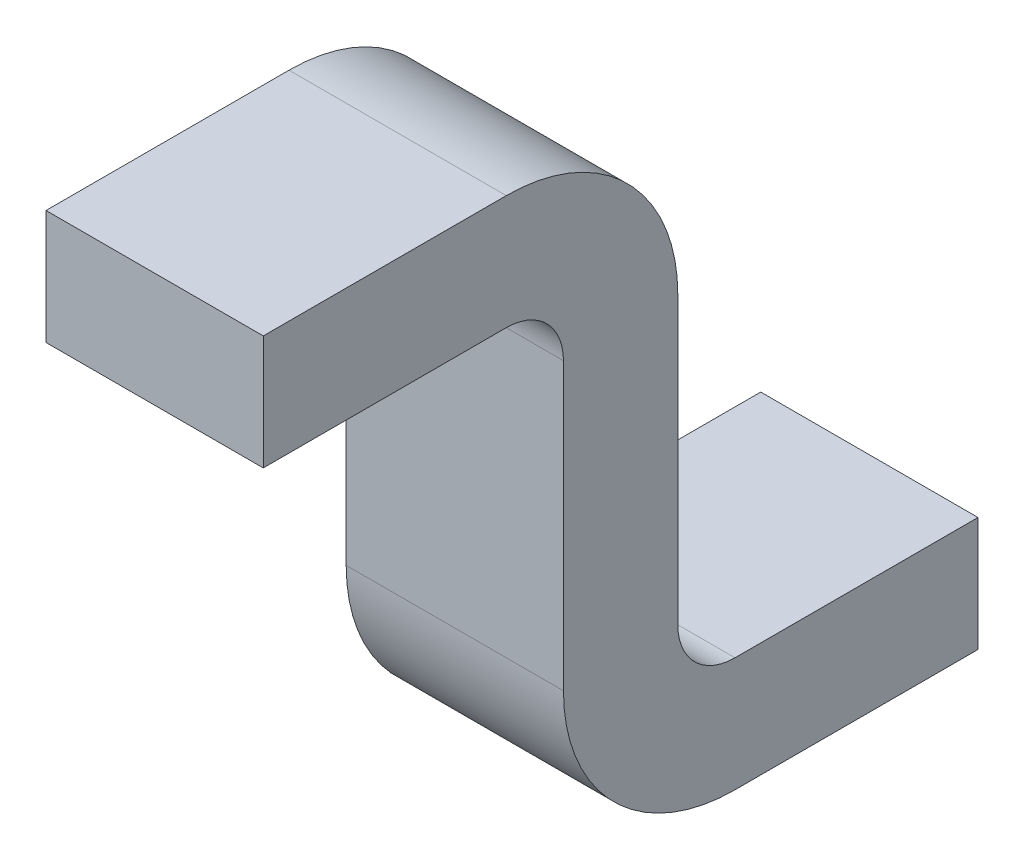
ISO-10303-21;
HEADER;
FILE_DESCRIPTION(('STEP AP214'),'2;1');
FILE_NAME('part.step','',(''),(''),'','','');
FILE_SCHEMA(('AUTOMOTIVE_DESIGN { 1 0 10303 214 1 1 1 1 }'));
ENDSEC;
DATA;
#1=APPLICATION_CONTEXT('core data for automotive mechanical design processes');
#2=APPLICATION_PROTOCOL_DEFINITION('international standard','automotive_design',2000,#1);
#3=PRODUCT_CONTEXT('',#1,'mechanical');
#4=PRODUCT('Part','Part','',(#3));
#5=PRODUCT_RELATED_PRODUCT_CATEGORY('part','',(#4));
#6=PRODUCT_DEFINITION_FORMATION('','',#4);
#7=PRODUCT_DEFINITION_CONTEXT('part definition',#1,'design');
#8=PRODUCT_DEFINITION('design','',#6,#7);
#9=PRODUCT_DEFINITION_SHAPE('','',#8);
#10=(LENGTH_UNIT() NAMED_UNIT(*) SI_UNIT(.MILLI.,.METRE.));
#11=(NAMED_UNIT(*) PLANE_ANGLE_UNIT() SI_UNIT($,.RADIAN.));
#12=(NAMED_UNIT(*) SI_UNIT($,.STERADIAN.) SOLID_ANGLE_UNIT());
#13=UNCERTAINTY_MEASURE_WITH_UNIT(LENGTH_MEASURE(1.E-05),#10,'distance_accuracy_value','');
#14=(GEOMETRIC_REPRESENTATION_CONTEXT(3) GLOBAL_UNCERTAINTY_ASSIGNED_CONTEXT((#13)) GLOBAL_UNIT_ASSIGNED_CONTEXT((#10,
#11,#12)) REPRESENTATION_CONTEXT('',''));
#15=CARTESIAN_POINT('',(0.,0.,0.));
#16=DIRECTION('',(0.,0.,1.));
#17=DIRECTION('',(1.,0.,0.));
#18=AXIS2_PLACEMENT_3D('',#15,#16,#17);
#19=CARTESIAN_POINT('',(0.38,0.8,-0.425));
#20=DIRECTION('',(-1.,0.,0.));
#21=DIRECTION('',(0.,0.,1.));
#22=AXIS2_PLACEMENT_3D('',#19,#20,#21);
#23=CYLINDRICAL_SURFACE('',#22,0.1);
#24=CARTESIAN_POINT('',(0.,0.8,-0.425));
#25=DIRECTION('',(-1.,0.,0.));
#26=DIRECTION('',(0.,0.,-1.));
#27=AXIS2_PLACEMENT_3D('',#24,#25,#26);
#28=CIRCLE('',#27,0.1);
#29=CARTESIAN_POINT('',(0.,0.9,-0.424999999999999));
#30=VERTEX_POINT('',#29);
#31=CARTESIAN_POINT('',(0.,0.799999999999999,-0.525));
#32=VERTEX_POINT('',#31);
#33=EDGE_CURVE('E151',#30,#32,#28,.T.);
#34=ORIENTED_EDGE('',*,*,#33,.T.);
#35=DIRECTION('',(-1.,0.,0.));
#36=VECTOR('',#35,1.);
#37=CARTESIAN_POINT('',(0.38,0.799999999999999,-0.525));
#38=LINE('',#37,#36);
#39=CARTESIAN_POINT('',(0.38,0.799999999999999,-0.525));
#40=VERTEX_POINT('',#39);
#41=EDGE_CURVE('E11',#40,#32,#38,.T.);
#42=ORIENTED_EDGE('',*,*,#41,.F.);
#43=CARTESIAN_POINT('',(0.38,0.8,-0.425));
#44=DIRECTION('',(-1.,0.,0.));
#45=DIRECTION('',(0.,0.,-1.));
#46=AXIS2_PLACEMENT_3D('',#43,#44,#45);
#47=CIRCLE('',#46,0.1);
#48=CARTESIAN_POINT('',(0.38,0.9,-0.424999999999999));
#49=VERTEX_POINT('',#48);
#50=EDGE_CURVE('E173',#49,#40,#47,.T.);
#51=ORIENTED_EDGE('',*,*,#50,.F.);
#52=DIRECTION('',(-1.,0.,0.));
#53=VECTOR('',#52,1.);
#54=CARTESIAN_POINT('',(0.38,0.9,-0.424999999999999));
#55=LINE('',#54,#53);
#56=EDGE_CURVE('E147',#49,#30,#55,.T.);
#57=ORIENTED_EDGE('',*,*,#56,.T.);
#58=EDGE_LOOP('',(#34,#42,#51,#57));
#59=FACE_BOUND('',#58,.T.);
#60=ADVANCED_FACE('F31',(#59),#23,.F.);
#61=CARTESIAN_POINT('',(0.38,0.799999999999999,-0.525));
#62=DIRECTION('',(0.,0.,-1.));
#63=DIRECTION('',(0.,1.,0.));
#64=AXIS2_PLACEMENT_3D('',#61,#62,#63);
#65=PLANE('',#64);
#66=DIRECTION('',(0.,-1.,0.));
#67=VECTOR('',#66,1.);
#68=CARTESIAN_POINT('',(0.,0.799999999999999,-0.525));
#69=LINE('',#68,#67);
#70=CARTESIAN_POINT('',(0.,0.300000000000002,-0.525));
#71=VERTEX_POINT('',#70);
#72=EDGE_CURVE('E154',#32,#71,#69,.T.);
#73=ORIENTED_EDGE('',*,*,#72,.T.);
#74=DIRECTION('',(-1.,0.,0.));
#75=VECTOR('',#74,1.);
#76=CARTESIAN_POINT('',(0.38,0.300000000000002,-0.525));
#77=LINE('',#76,#75);
#78=CARTESIAN_POINT('',(0.38,0.300000000000002,-0.525));
#79=VERTEX_POINT('',#78);
#80=EDGE_CURVE('E39',#79,#71,#77,.T.);
#81=ORIENTED_EDGE('',*,*,#80,.F.);
#82=DIRECTION('',(0.,-1.,0.));
#83=VECTOR('',#82,1.);
#84=CARTESIAN_POINT('',(0.38,0.799999999999999,-0.525));
#85=LINE('',#84,#83);
#86=EDGE_CURVE('E102',#40,#79,#85,.T.);
#87=ORIENTED_EDGE('',*,*,#86,.F.);
#88=ORIENTED_EDGE('',*,*,#41,.T.);
#89=EDGE_LOOP('',(#73,#81,#87,#88));
#90=FACE_BOUND('',#89,.T.);
#91=ADVANCED_FACE('F251',(#90),#65,.F.);
#92=CARTESIAN_POINT('',(0.38,0.3,-0.825));
#93=DIRECTION('',(-1.,0.,0.));
#94=DIRECTION('',(0.,0.,1.));
#95=AXIS2_PLACEMENT_3D('',#92,#93,#94);
#96=CYLINDRICAL_SURFACE('',#95,0.3);
#97=CARTESIAN_POINT('',(0.,0.3,-0.825));
#98=DIRECTION('',(1.,0.,0.));
#99=DIRECTION('',(0.,0.,1.));
#100=AXIS2_PLACEMENT_3D('',#97,#98,#99);
#101=CIRCLE('',#100,0.3);
#102=CARTESIAN_POINT('',(0.,0.,-0.825000000000003));
#103=VERTEX_POINT('',#102);
#104=EDGE_CURVE('E156',#71,#103,#101,.T.);
#105=ORIENTED_EDGE('',*,*,#104,.T.);
#106=DIRECTION('',(-1.,0.,0.));
#107=VECTOR('',#106,1.);
#108=CARTESIAN_POINT('',(0.38,0.,-0.825000000000003));
#109=LINE('',#108,#107);
#110=CARTESIAN_POINT('',(0.38,0.,-0.825000000000003));
#111=VERTEX_POINT('',#110);
#112=EDGE_CURVE('E192',#111,#103,#109,.T.);
#113=ORIENTED_EDGE('',*,*,#112,.F.);
#114=CARTESIAN_POINT('',(0.38,0.3,-0.825));
#115=DIRECTION('',(1.,0.,0.));
#116=DIRECTION('',(0.,0.,1.));
#117=AXIS2_PLACEMENT_3D('',#114,#115,#116);
#118=CIRCLE('',#117,0.3);
#119=EDGE_CURVE('E200',#79,#111,#118,.T.);
#120=ORIENTED_EDGE('',*,*,#119,.F.);
#121=ORIENTED_EDGE('',*,*,#80,.T.);
#122=EDGE_LOOP('',(#105,#113,#120,#121));
#123=FACE_BOUND('',#122,.T.);
#124=ADVANCED_FACE('F198',(#123),#96,.T.);
#125=CARTESIAN_POINT('',(0.38,0.,-0.825000000000003));
#126=DIRECTION('',(0.,1.,0.));
#127=DIRECTION('',(0.,0.,1.));
#128=AXIS2_PLACEMENT_3D('',#125,#126,#127);
#129=PLANE('',#128);
#130=DIRECTION('',(0.,0.,-1.));
#131=VECTOR('',#130,1.);
#132=CARTESIAN_POINT('',(0.,0.,-0.825000000000003));
#133=LINE('',#132,#131);
#134=CARTESIAN_POINT('',(0.,0.,-1.25));
#135=VERTEX_POINT('',#134);
#136=EDGE_CURVE('E158',#103,#135,#133,.T.);
#137=ORIENTED_EDGE('',*,*,#136,.T.);
#138=DIRECTION('',(-1.,0.,0.));
#139=VECTOR('',#138,1.);
#140=CARTESIAN_POINT('',(0.38,0.,-1.25));
#141=LINE('',#140,#139);
#142=CARTESIAN_POINT('',(0.38,0.,-1.25));
#143=VERTEX_POINT('',#142);
#144=EDGE_CURVE('E189',#143,#135,#141,.T.);
#145=ORIENTED_EDGE('',*,*,#144,.F.);
#146=DIRECTION('',(0.,0.,-1.));
#147=VECTOR('',#146,1.);
#148=CARTESIAN_POINT('',(0.38,0.,-0.825000000000003));
#149=LINE('',#148,#147);
#150=EDGE_CURVE('E218',#111,#143,#149,.T.);
#151=ORIENTED_EDGE('',*,*,#150,.F.);
#152=ORIENTED_EDGE('',*,*,#112,.T.);
#153=EDGE_LOOP('',(#137,#145,#151,#152));
#154=FACE_BOUND('',#153,.T.);
#155=ADVANCED_FACE('F209',(#154),#129,.F.);
#156=CARTESIAN_POINT('',(0.38,0.,-1.25));
#157=DIRECTION('',(0.,0.,1.));
#158=DIRECTION('',(1.,0.,0.));
#159=AXIS2_PLACEMENT_3D('',#156,#157,#158);
#160=PLANE('',#159);
#161=DIRECTION('',(0.,1.,0.));
#162=VECTOR('',#161,1.);
#163=CARTESIAN_POINT('',(0.,0.,-1.25));
#164=LINE('',#163,#162);
#165=CARTESIAN_POINT('',(0.,0.2,-1.25));
#166=VERTEX_POINT('',#165);
#167=EDGE_CURVE('E160',#135,#166,#164,.T.);
#168=ORIENTED_EDGE('',*,*,#167,.T.);
#169=DIRECTION('',(-1.,0.,0.));
#170=VECTOR('',#169,1.);
#171=CARTESIAN_POINT('',(0.38,0.2,-1.25));
#172=LINE('',#171,#170);
#173=CARTESIAN_POINT('',(0.38,0.2,-1.25));
#174=VERTEX_POINT('',#173);
#175=EDGE_CURVE('E186',#174,#166,#172,.T.);
#176=ORIENTED_EDGE('',*,*,#175,.F.);
#177=DIRECTION('',(0.,1.,0.));
#178=VECTOR('',#177,1.);
#179=CARTESIAN_POINT('',(0.38,0.,-1.25));
#180=LINE('',#179,#178);
#181=EDGE_CURVE('E215',#143,#174,#180,.T.);
#182=ORIENTED_EDGE('',*,*,#181,.F.);
#183=ORIENTED_EDGE('',*,*,#144,.T.);
#184=EDGE_LOOP('',(#168,#176,#182,#183));
#185=FACE_BOUND('',#184,.T.);
#186=ADVANCED_FACE('F213',(#185),#160,.F.);
#187=CARTESIAN_POINT('',(0.38,0.2,-0.825000000000001));
#188=DIRECTION('',(0.,-1.,0.));
#189=DIRECTION('',(0.,0.,-1.));
#190=AXIS2_PLACEMENT_3D('',#187,#188,#189);
#191=PLANE('',#190);
#192=DIRECTION('',(0.,0.,1.));
#193=VECTOR('',#192,1.);
#194=CARTESIAN_POINT('',(0.,0.2,-0.825000000000001));
#195=LINE('',#194,#193);
#196=CARTESIAN_POINT('',(0.,0.2,-0.825000000000001));
#197=VERTEX_POINT('',#196);
#198=EDGE_CURVE('E162',#166,#197,#195,.T.);
#199=ORIENTED_EDGE('',*,*,#198,.T.);
#200=DIRECTION('',(-1.,0.,0.));
#201=VECTOR('',#200,1.);
#202=CARTESIAN_POINT('',(0.38,0.2,-0.825000000000001));
#203=LINE('',#202,#201);
#204=CARTESIAN_POINT('',(0.38,0.2,-0.825000000000001));
#205=VERTEX_POINT('',#204);
#206=EDGE_CURVE('E183',#205,#197,#203,.T.);
#207=ORIENTED_EDGE('',*,*,#206,.F.);
#208=DIRECTION('',(0.,0.,1.));
#209=VECTOR('',#208,1.);
#210=CARTESIAN_POINT('',(0.38,0.2,-0.825000000000001));
#211=LINE('',#210,#209);
#212=EDGE_CURVE('E217',#174,#205,#211,.T.);
#213=ORIENTED_EDGE('',*,*,#212,.F.);
#214=ORIENTED_EDGE('',*,*,#175,.T.);
#215=EDGE_LOOP('',(#199,#207,#213,#214));
#216=FACE_BOUND('',#215,.T.);
#217=ADVANCED_FACE('F264',(#216),#191,.F.);
#218=CARTESIAN_POINT('',(0.38,0.3,-0.825));
#219=DIRECTION('',(-1.,0.,0.));
#220=DIRECTION('',(0.,0.,1.));
#221=AXIS2_PLACEMENT_3D('',#218,#219,#220);
#222=CYLINDRICAL_SURFACE('',#221,0.1);
#223=CARTESIAN_POINT('',(0.,0.3,-0.825));
#224=DIRECTION('',(-1.,0.,0.));
#225=DIRECTION('',(0.,0.,1.));
#226=AXIS2_PLACEMENT_3D('',#223,#224,#225);
#227=CIRCLE('',#226,0.1);
#228=CARTESIAN_POINT('',(0.,0.300000000000001,-0.725));
#229=VERTEX_POINT('',#228);
#230=EDGE_CURVE('E164',#197,#229,#227,.T.);
#231=ORIENTED_EDGE('',*,*,#230,.T.);
#232=DIRECTION('',(-1.,0.,0.));
#233=VECTOR('',#232,1.);
#234=CARTESIAN_POINT('',(0.38,0.300000000000001,-0.725));
#235=LINE('',#234,#233);
#236=CARTESIAN_POINT('',(0.38,0.300000000000001,-0.725));
#237=VERTEX_POINT('',#236);
#238=EDGE_CURVE('E180',#237,#229,#235,.T.);
#239=ORIENTED_EDGE('',*,*,#238,.F.);
#240=CARTESIAN_POINT('',(0.38,0.3,-0.825));
#241=DIRECTION('',(-1.,0.,0.));
#242=DIRECTION('',(0.,0.,1.));
#243=AXIS2_PLACEMENT_3D('',#240,#241,#242);
#244=CIRCLE('',#243,0.1);
#245=EDGE_CURVE('E220',#205,#237,#244,.T.);
#246=ORIENTED_EDGE('',*,*,#245,.F.);
#247=ORIENTED_EDGE('',*,*,#206,.T.);
#248=EDGE_LOOP('',(#231,#239,#246,#247));
#249=FACE_BOUND('',#248,.T.);
#250=ADVANCED_FACE('F267',(#249),#222,.F.);
#251=CARTESIAN_POINT('',(0.38,0.799999999999998,-0.725));
#252=DIRECTION('',(0.,0.,1.));
#253=DIRECTION('',(0.,-1.,0.));
#254=AXIS2_PLACEMENT_3D('',#251,#252,#253);
#255=PLANE('',#254);
#256=DIRECTION('',(0.,1.,0.));
#257=VECTOR('',#256,1.);
#258=CARTESIAN_POINT('',(0.,0.799999999999998,-0.725));
#259=LINE('',#258,#257);
#260=CARTESIAN_POINT('',(0.,0.799999999999998,-0.725));
#261=VERTEX_POINT('',#260);
#262=EDGE_CURVE('E166',#229,#261,#259,.T.);
#263=ORIENTED_EDGE('',*,*,#262,.T.);
#264=DIRECTION('',(-1.,0.,0.));
#265=VECTOR('',#264,1.);
#266=CARTESIAN_POINT('',(0.38,0.799999999999998,-0.725));
#267=LINE('',#266,#265);
#268=CARTESIAN_POINT('',(0.38,0.799999999999998,-0.725));
#269=VERTEX_POINT('',#268);
#270=EDGE_CURVE('E177',#269,#261,#267,.T.);
#271=ORIENTED_EDGE('',*,*,#270,.F.);
#272=DIRECTION('',(0.,1.,0.));
#273=VECTOR('',#272,1.);
#274=CARTESIAN_POINT('',(0.38,0.799999999999998,-0.725));
#275=LINE('',#274,#273);
#276=EDGE_CURVE('E226',#237,#269,#275,.T.);
#277=ORIENTED_EDGE('',*,*,#276,.F.);
#278=ORIENTED_EDGE('',*,*,#238,.T.);
#279=EDGE_LOOP('',(#263,#271,#277,#278));
#280=FACE_BOUND('',#279,.T.);
#281=ADVANCED_FACE('F232',(#280),#255,.F.);
#282=CARTESIAN_POINT('',(0.38,0.8,-0.425));
#283=DIRECTION('',(-1.,0.,0.));
#284=DIRECTION('',(0.,0.,1.));
#285=AXIS2_PLACEMENT_3D('',#282,#283,#284);
#286=CYLINDRICAL_SURFACE('',#285,0.3);
#287=CARTESIAN_POINT('',(0.,0.8,-0.425));
#288=DIRECTION('',(1.,0.,0.));
#289=DIRECTION('',(0.,0.,-1.));
#290=AXIS2_PLACEMENT_3D('',#287,#288,#289);
#291=CIRCLE('',#290,0.3);
#292=CARTESIAN_POINT('',(0.,1.1,-0.424999999999998));
#293=VERTEX_POINT('',#292);
#294=EDGE_CURVE('E168',#261,#293,#291,.T.);
#295=ORIENTED_EDGE('',*,*,#294,.T.);
#296=DIRECTION('',(-1.,0.,0.));
#297=VECTOR('',#296,1.);
#298=CARTESIAN_POINT('',(0.38,1.1,-0.424999999999998));
#299=LINE('',#298,#297);
#300=CARTESIAN_POINT('',(0.38,1.1,-0.424999999999998));
#301=VERTEX_POINT('',#300);
#302=EDGE_CURVE('E142',#301,#293,#299,.T.);
#303=ORIENTED_EDGE('',*,*,#302,.F.);
#304=CARTESIAN_POINT('',(0.38,0.8,-0.425));
#305=DIRECTION('',(1.,0.,0.));
#306=DIRECTION('',(0.,0.,-1.));
#307=AXIS2_PLACEMENT_3D('',#304,#305,#306);
#308=CIRCLE('',#307,0.3);
#309=EDGE_CURVE('E133',#269,#301,#308,.T.);
#310=ORIENTED_EDGE('',*,*,#309,.F.);
#311=ORIENTED_EDGE('',*,*,#270,.T.);
#312=EDGE_LOOP('',(#295,#303,#310,#311));
#313=FACE_BOUND('',#312,.T.);
#314=ADVANCED_FACE('F236',(#313),#286,.T.);
#315=CARTESIAN_POINT('',(0.38,1.1,0.));
#316=DIRECTION('',(0.,-1.,0.));
#317=DIRECTION('',(0.,0.,-1.));
#318=AXIS2_PLACEMENT_3D('',#315,#316,#317);
#319=PLANE('',#318);
#320=DIRECTION('',(0.,0.,1.));
#321=VECTOR('',#320,1.);
#322=CARTESIAN_POINT('',(0.,1.1,0.));
#323=LINE('',#322,#321);
#324=CARTESIAN_POINT('',(0.,1.1,0.));
#325=VERTEX_POINT('',#324);
#326=EDGE_CURVE('E141',#293,#325,#323,.T.);
#327=ORIENTED_EDGE('',*,*,#326,.T.);
#328=DIRECTION('',(-1.,0.,0.));
#329=VECTOR('',#328,1.);
#330=CARTESIAN_POINT('',(0.38,1.1,0.));
#331=LINE('',#330,#329);
#332=CARTESIAN_POINT('',(0.38,1.1,0.));
#333=VERTEX_POINT('',#332);
#334=EDGE_CURVE('E138',#333,#325,#331,.T.);
#335=ORIENTED_EDGE('',*,*,#334,.F.);
#336=DIRECTION('',(0.,0.,1.));
#337=VECTOR('',#336,1.);
#338=CARTESIAN_POINT('',(0.38,1.1,0.));
#339=LINE('',#338,#337);
#340=EDGE_CURVE('E127',#301,#333,#339,.T.);
#341=ORIENTED_EDGE('',*,*,#340,.F.);
#342=ORIENTED_EDGE('',*,*,#302,.T.);
#343=EDGE_LOOP('',(#327,#335,#341,#342));
#344=FACE_BOUND('',#343,.T.);
#345=ADVANCED_FACE('F139',(#344),#319,.F.);
#346=CARTESIAN_POINT('',(0.38,0.9,0.));
#347=DIRECTION('',(0.,0.,-1.));
#348=DIRECTION('',(-1.,0.,0.));
#349=AXIS2_PLACEMENT_3D('',#346,#347,#348);
#350=PLANE('',#349);
#351=DIRECTION('',(0.,-1.,0.));
#352=VECTOR('',#351,1.);
#353=CARTESIAN_POINT('',(0.,0.9,0.));
#354=LINE('',#353,#352);
#355=CARTESIAN_POINT('',(0.,0.9,0.));
#356=VERTEX_POINT('',#355);
#357=EDGE_CURVE('E88',#325,#356,#354,.T.);
#358=ORIENTED_EDGE('',*,*,#357,.T.);
#359=DIRECTION('',(-1.,0.,0.));
#360=VECTOR('',#359,1.);
#361=CARTESIAN_POINT('',(0.38,0.9,0.));
#362=LINE('',#361,#360);
#363=CARTESIAN_POINT('',(0.38,0.9,0.));
#364=VERTEX_POINT('',#363);
#365=EDGE_CURVE('E143',#364,#356,#362,.T.);
#366=ORIENTED_EDGE('',*,*,#365,.F.);
#367=DIRECTION('',(0.,-1.,0.));
#368=VECTOR('',#367,1.);
#369=CARTESIAN_POINT('',(0.38,0.9,0.));
#370=LINE('',#369,#368);
#371=EDGE_CURVE('E131',#333,#364,#370,.T.);
#372=ORIENTED_EDGE('',*,*,#371,.F.);
#373=ORIENTED_EDGE('',*,*,#334,.T.);
#374=EDGE_LOOP('',(#358,#366,#372,#373));
#375=FACE_BOUND('',#374,.T.);
#376=ADVANCED_FACE('F145',(#375),#350,.F.);
#377=CARTESIAN_POINT('',(0.38,0.9,0.));
#378=DIRECTION('',(0.,1.,0.));
#379=DIRECTION('',(0.,0.,1.));
#380=AXIS2_PLACEMENT_3D('',#377,#378,#379);
#381=PLANE('',#380);
#382=DIRECTION('',(0.,0.,-1.));
#383=VECTOR('',#382,1.);
#384=CARTESIAN_POINT('',(0.,0.9,0.));
#385=LINE('',#384,#383);
#386=EDGE_CURVE('E94',#356,#30,#385,.T.);
#387=ORIENTED_EDGE('',*,*,#386,.T.);
#388=ORIENTED_EDGE('',*,*,#56,.F.);
#389=DIRECTION('',(0.,0.,-1.));
#390=VECTOR('',#389,1.);
#391=CARTESIAN_POINT('',(0.38,0.9,0.));
#392=LINE('',#391,#390);
#393=EDGE_CURVE('E47',#364,#49,#392,.T.);
#394=ORIENTED_EDGE('',*,*,#393,.F.);
#395=ORIENTED_EDGE('',*,*,#365,.T.);
#396=EDGE_LOOP('',(#387,#388,#394,#395));
#397=FACE_BOUND('',#396,.T.);
#398=ADVANCED_FACE('F240',(#397),#381,.F.);
#399=CARTESIAN_POINT('',(0.38,0.8,-0.425));
#400=DIRECTION('',(1.,0.,0.));
#401=DIRECTION('',(0.,0.,-1.));
#402=AXIS2_PLACEMENT_3D('',#399,#400,#401);
#403=PLANE('',#402);
#404=ORIENTED_EDGE('',*,*,#50,.T.);
#405=ORIENTED_EDGE('',*,*,#86,.T.);
#406=ORIENTED_EDGE('',*,*,#119,.T.);
#407=ORIENTED_EDGE('',*,*,#150,.T.);
#408=ORIENTED_EDGE('',*,*,#181,.T.);
#409=ORIENTED_EDGE('',*,*,#212,.T.);
#410=ORIENTED_EDGE('',*,*,#245,.T.);
#411=ORIENTED_EDGE('',*,*,#276,.T.);
#412=ORIENTED_EDGE('',*,*,#309,.T.);
#413=ORIENTED_EDGE('',*,*,#340,.T.);
#414=ORIENTED_EDGE('',*,*,#371,.T.);
#415=ORIENTED_EDGE('',*,*,#393,.T.);
#416=EDGE_LOOP('',(#404,#405,#406,#407,#408,#409,#410,#411,#412,#413,#414,#415));
#417=FACE_BOUND('',#416,.T.);
#418=ADVANCED_FACE('F129',(#417),#403,.T.);
#419=CARTESIAN_POINT('',(0.,0.8,-0.425));
#420=DIRECTION('',(1.,0.,0.));
#421=DIRECTION('',(0.,0.,-1.));
#422=AXIS2_PLACEMENT_3D('',#419,#420,#421);
#423=PLANE('',#422);
#424=ORIENTED_EDGE('',*,*,#33,.F.);
#425=ORIENTED_EDGE('',*,*,#386,.F.);
#426=ORIENTED_EDGE('',*,*,#357,.F.);
#427=ORIENTED_EDGE('',*,*,#326,.F.);
#428=ORIENTED_EDGE('',*,*,#294,.F.);
#429=ORIENTED_EDGE('',*,*,#262,.F.);
#430=ORIENTED_EDGE('',*,*,#230,.F.);
#431=ORIENTED_EDGE('',*,*,#198,.F.);
#432=ORIENTED_EDGE('',*,*,#167,.F.);
#433=ORIENTED_EDGE('',*,*,#136,.F.);
#434=ORIENTED_EDGE('',*,*,#104,.F.);
#435=ORIENTED_EDGE('',*,*,#72,.F.);
#436=EDGE_LOOP('',(#424,#425,#426,#427,#428,#429,#430,#431,#432,#433,#434,#435));
#437=FACE_BOUND('',#436,.T.);
#438=ADVANCED_FACE('F204',(#437),#423,.F.);
#439=CLOSED_SHELL('',(#60,#91,#124,#155,#186,#217,#250,#281,#314,#345,#376,#398,#418,#438));
#440=MANIFOLD_SOLID_BREP('B2',#439);
#441=ADVANCED_BREP_SHAPE_REPRESENTATION('',(#18,#440),#14);
#442=SHAPE_DEFINITION_REPRESENTATION(#9,#441);
ENDSEC;
END-ISO-10303-21;
